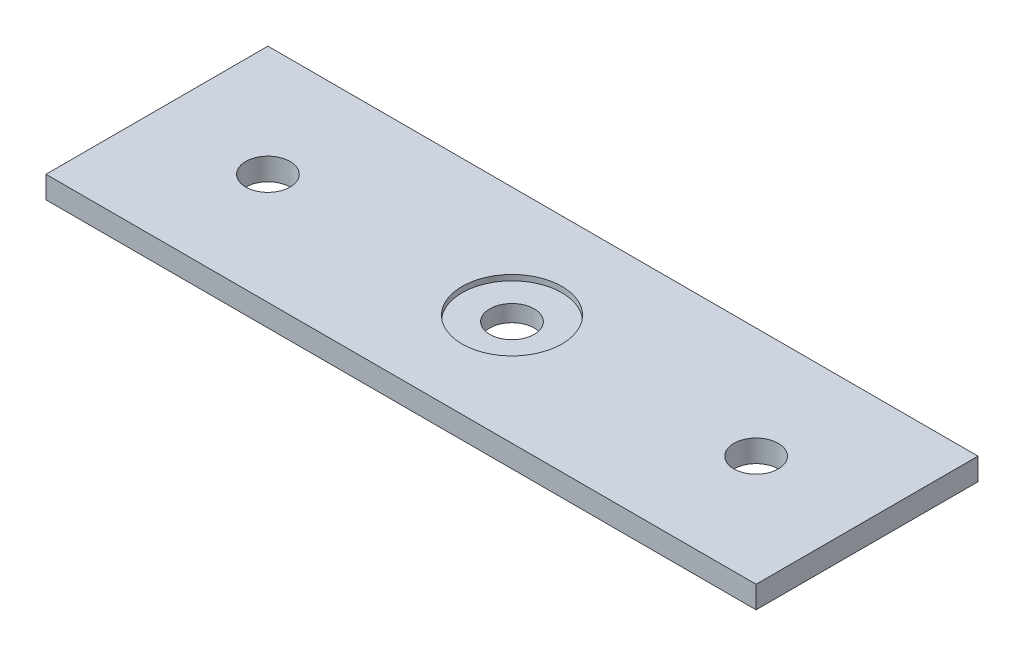
ISO-10303-21;
HEADER;
FILE_DESCRIPTION(('STEP AP214'),'2;1');
FILE_NAME('part.step','',(''),(''),'','','');
FILE_SCHEMA(('AUTOMOTIVE_DESIGN { 1 0 10303 214 1 1 1 1 }'));
ENDSEC;
DATA;
#1=APPLICATION_CONTEXT('core data for automotive mechanical design processes');
#2=APPLICATION_PROTOCOL_DEFINITION('international standard','automotive_design',2000,#1);
#3=PRODUCT_CONTEXT('',#1,'mechanical');
#4=PRODUCT('Part','Part','',(#3));
#5=PRODUCT_RELATED_PRODUCT_CATEGORY('part','',(#4));
#6=PRODUCT_DEFINITION_FORMATION('','',#4);
#7=PRODUCT_DEFINITION_CONTEXT('part definition',#1,'design');
#8=PRODUCT_DEFINITION('design','',#6,#7);
#9=PRODUCT_DEFINITION_SHAPE('','',#8);
#10=(LENGTH_UNIT() NAMED_UNIT(*) SI_UNIT(.MILLI.,.METRE.));
#11=(NAMED_UNIT(*) PLANE_ANGLE_UNIT() SI_UNIT($,.RADIAN.));
#12=(NAMED_UNIT(*) SI_UNIT($,.STERADIAN.) SOLID_ANGLE_UNIT());
#13=UNCERTAINTY_MEASURE_WITH_UNIT(LENGTH_MEASURE(1.E-05),#10,'distance_accuracy_value','');
#14=(GEOMETRIC_REPRESENTATION_CONTEXT(3) GLOBAL_UNCERTAINTY_ASSIGNED_CONTEXT((#13)) GLOBAL_UNIT_ASSIGNED_CONTEXT((#10,
#11,#12)) REPRESENTATION_CONTEXT('',''));
#15=CARTESIAN_POINT('',(0.,0.,0.));
#16=DIRECTION('',(0.,0.,1.));
#17=DIRECTION('',(1.,0.,0.));
#18=AXIS2_PLACEMENT_3D('',#15,#16,#17);
#19=CARTESIAN_POINT('',(0.,6.35,0.));
#20=DIRECTION('',(-1.,0.,0.));
#21=DIRECTION('',(0.,0.,1.));
#22=AXIS2_PLACEMENT_3D('',#19,#20,#21);
#23=PLANE('',#22);
#24=DIRECTION('',(0.,0.,-1.));
#25=VECTOR('',#24,1.);
#26=CARTESIAN_POINT('',(0.,0.,0.));
#27=LINE('',#26,#25);
#28=CARTESIAN_POINT('',(0.,0.,0.));
#29=VERTEX_POINT('',#28);
#30=CARTESIAN_POINT('',(0.,0.,-63.5));
#31=VERTEX_POINT('',#30);
#32=EDGE_CURVE('E100',#29,#31,#27,.T.);
#33=ORIENTED_EDGE('',*,*,#32,.T.);
#34=DIRECTION('',(0.,-1.,0.));
#35=VECTOR('',#34,1.);
#36=CARTESIAN_POINT('',(0.,6.35,-63.5));
#37=LINE('',#36,#35);
#38=CARTESIAN_POINT('',(0.,6.35,-63.5));
#39=VERTEX_POINT('',#38);
#40=EDGE_CURVE('E11',#39,#31,#37,.T.);
#41=ORIENTED_EDGE('',*,*,#40,.F.);
#42=DIRECTION('',(0.,0.,-1.));
#43=VECTOR('',#42,1.);
#44=CARTESIAN_POINT('',(0.,6.35,0.));
#45=LINE('',#44,#43);
#46=CARTESIAN_POINT('',(0.,6.35,0.));
#47=VERTEX_POINT('',#46);
#48=EDGE_CURVE('E88',#47,#39,#45,.T.);
#49=ORIENTED_EDGE('',*,*,#48,.F.);
#50=DIRECTION('',(0.,-1.,0.));
#51=VECTOR('',#50,1.);
#52=CARTESIAN_POINT('',(0.,6.35,0.));
#53=LINE('',#52,#51);
#54=EDGE_CURVE('E96',#47,#29,#53,.T.);
#55=ORIENTED_EDGE('',*,*,#54,.T.);
#56=EDGE_LOOP('',(#33,#41,#49,#55));
#57=FACE_BOUND('',#56,.T.);
#58=ADVANCED_FACE('F37',(#57),#23,.F.);
#59=CARTESIAN_POINT('',(0.,6.35,-63.5));
#60=DIRECTION('',(0.,0.,1.));
#61=DIRECTION('',(1.,0.,0.));
#62=AXIS2_PLACEMENT_3D('',#59,#60,#61);
#63=PLANE('',#62);
#64=DIRECTION('',(-1.,0.,0.));
#65=VECTOR('',#64,1.);
#66=CARTESIAN_POINT('',(0.,0.,-63.5));
#67=LINE('',#66,#65);
#68=CARTESIAN_POINT('',(-203.2,0.,-63.5));
#69=VERTEX_POINT('',#68);
#70=EDGE_CURVE('E92',#31,#69,#67,.T.);
#71=ORIENTED_EDGE('',*,*,#70,.T.);
#72=DIRECTION('',(0.,-1.,0.));
#73=VECTOR('',#72,1.);
#74=CARTESIAN_POINT('',(-203.2,6.35,-63.5));
#75=LINE('',#74,#73);
#76=CARTESIAN_POINT('',(-203.2,6.35,-63.5));
#77=VERTEX_POINT('',#76);
#78=EDGE_CURVE('E45',#77,#69,#75,.T.);
#79=ORIENTED_EDGE('',*,*,#78,.F.);
#80=DIRECTION('',(-1.,0.,0.));
#81=VECTOR('',#80,1.);
#82=CARTESIAN_POINT('',(0.,6.35,-63.5));
#83=LINE('',#82,#81);
#84=EDGE_CURVE('E83',#39,#77,#83,.T.);
#85=ORIENTED_EDGE('',*,*,#84,.F.);
#86=ORIENTED_EDGE('',*,*,#40,.T.);
#87=EDGE_LOOP('',(#71,#79,#85,#86));
#88=FACE_BOUND('',#87,.T.);
#89=ADVANCED_FACE('F91',(#88),#63,.F.);
#90=CARTESIAN_POINT('',(-203.2,6.35,0.));
#91=DIRECTION('',(1.,0.,0.));
#92=DIRECTION('',(0.,0.,-1.));
#93=AXIS2_PLACEMENT_3D('',#90,#91,#92);
#94=PLANE('',#93);
#95=DIRECTION('',(0.,0.,1.));
#96=VECTOR('',#95,1.);
#97=CARTESIAN_POINT('',(-203.2,0.,0.));
#98=LINE('',#97,#96);
#99=CARTESIAN_POINT('',(-203.2,0.,0.));
#100=VERTEX_POINT('',#99);
#101=EDGE_CURVE('E70',#69,#100,#98,.T.);
#102=ORIENTED_EDGE('',*,*,#101,.T.);
#103=DIRECTION('',(0.,-1.,0.));
#104=VECTOR('',#103,1.);
#105=CARTESIAN_POINT('',(-203.2,6.35,0.));
#106=LINE('',#105,#104);
#107=CARTESIAN_POINT('',(-203.2,6.35,0.));
#108=VERTEX_POINT('',#107);
#109=EDGE_CURVE('E93',#108,#100,#106,.T.);
#110=ORIENTED_EDGE('',*,*,#109,.F.);
#111=DIRECTION('',(0.,0.,1.));
#112=VECTOR('',#111,1.);
#113=CARTESIAN_POINT('',(-203.2,6.35,0.));
#114=LINE('',#113,#112);
#115=EDGE_CURVE('E86',#77,#108,#114,.T.);
#116=ORIENTED_EDGE('',*,*,#115,.F.);
#117=ORIENTED_EDGE('',*,*,#78,.T.);
#118=EDGE_LOOP('',(#102,#110,#116,#117));
#119=FACE_BOUND('',#118,.T.);
#120=ADVANCED_FACE('F94',(#119),#94,.F.);
#121=CARTESIAN_POINT('',(0.,6.35,0.));
#122=DIRECTION('',(0.,0.,-1.));
#123=DIRECTION('',(-1.,0.,0.));
#124=AXIS2_PLACEMENT_3D('',#121,#122,#123);
#125=PLANE('',#124);
#126=DIRECTION('',(1.,0.,0.));
#127=VECTOR('',#126,1.);
#128=CARTESIAN_POINT('',(0.,0.,0.));
#129=LINE('',#128,#127);
#130=EDGE_CURVE('E76',#100,#29,#129,.T.);
#131=ORIENTED_EDGE('',*,*,#130,.T.);
#132=ORIENTED_EDGE('',*,*,#54,.F.);
#133=DIRECTION('',(1.,0.,0.));
#134=VECTOR('',#133,1.);
#135=CARTESIAN_POINT('',(0.,6.35,0.));
#136=LINE('',#135,#134);
#137=EDGE_CURVE('E53',#108,#47,#136,.T.);
#138=ORIENTED_EDGE('',*,*,#137,.F.);
#139=ORIENTED_EDGE('',*,*,#109,.T.);
#140=EDGE_LOOP('',(#131,#132,#138,#139));
#141=FACE_BOUND('',#140,.T.);
#142=ADVANCED_FACE('F108',(#141),#125,.F.);
#143=CARTESIAN_POINT('',(0.,6.35,0.));
#144=DIRECTION('',(0.,1.,0.));
#145=DIRECTION('',(0.,0.,1.));
#146=AXIS2_PLACEMENT_3D('',#143,#144,#145);
#147=PLANE('',#146);
#148=CARTESIAN_POINT('',(-171.45,6.35,-31.75));
#149=DIRECTION('',(0.,1.,0.));
#150=DIRECTION('',(0.,0.,1.));
#151=AXIS2_PLACEMENT_3D('',#148,#149,#150);
#152=CIRCLE('',#151,6.35);
#153=CARTESIAN_POINT('',(-171.45,6.35,-25.4));
#154=VERTEX_POINT('',#153);
#155=EDGE_CURVE('E132',#154,#154,#152,.T.);
#156=ORIENTED_EDGE('',*,*,#155,.F.);
#157=EDGE_LOOP('',(#156));
#158=FACE_BOUND('',#157,.T.);
#159=CARTESIAN_POINT('',(-31.75,6.35,-31.75));
#160=DIRECTION('',(0.,1.,0.));
#161=DIRECTION('',(0.,0.,1.));
#162=AXIS2_PLACEMENT_3D('',#159,#160,#161);
#163=CIRCLE('',#162,6.35);
#164=CARTESIAN_POINT('',(-31.75,6.35,-25.4));
#165=VERTEX_POINT('',#164);
#166=EDGE_CURVE('E126',#165,#165,#163,.T.);
#167=ORIENTED_EDGE('',*,*,#166,.F.);
#168=EDGE_LOOP('',(#167));
#169=FACE_BOUND('',#168,.T.);
#170=CARTESIAN_POINT('',(-101.6,6.35,-31.75));
#171=DIRECTION('',(0.,1.,0.));
#172=DIRECTION('',(0.,0.,1.));
#173=AXIS2_PLACEMENT_3D('',#170,#171,#172);
#174=CIRCLE('',#173,14.2875);
#175=CARTESIAN_POINT('',(-101.6,6.35,-17.4625));
#176=VERTEX_POINT('',#175);
#177=EDGE_CURVE('E114',#176,#176,#174,.T.);
#178=ORIENTED_EDGE('',*,*,#177,.F.);
#179=EDGE_LOOP('',(#178));
#180=FACE_BOUND('',#179,.T.);
#181=ORIENTED_EDGE('',*,*,#48,.T.);
#182=ORIENTED_EDGE('',*,*,#84,.T.);
#183=ORIENTED_EDGE('',*,*,#115,.T.);
#184=ORIENTED_EDGE('',*,*,#137,.T.);
#185=EDGE_LOOP('',(#181,#182,#183,#184));
#186=FACE_BOUND('',#185,.T.);
#187=ADVANCED_FACE('F84',(#158,#169,#180,#186),#147,.T.);
#188=CARTESIAN_POINT('',(0.,0.,0.));
#189=DIRECTION('',(0.,1.,0.));
#190=DIRECTION('',(0.,0.,1.));
#191=AXIS2_PLACEMENT_3D('',#188,#189,#190);
#192=PLANE('',#191);
#193=CARTESIAN_POINT('',(-171.45,0.,-31.75));
#194=DIRECTION('',(0.,1.,0.));
#195=DIRECTION('',(0.,0.,1.));
#196=AXIS2_PLACEMENT_3D('',#193,#194,#195);
#197=CIRCLE('',#196,6.35);
#198=CARTESIAN_POINT('',(-171.45,0.,-25.4));
#199=VERTEX_POINT('',#198);
#200=EDGE_CURVE('E123',#199,#199,#197,.T.);
#201=ORIENTED_EDGE('',*,*,#200,.T.);
#202=EDGE_LOOP('',(#201));
#203=FACE_BOUND('',#202,.T.);
#204=CARTESIAN_POINT('',(-31.75,0.,-31.75));
#205=DIRECTION('',(0.,1.,0.));
#206=DIRECTION('',(0.,0.,1.));
#207=AXIS2_PLACEMENT_3D('',#204,#205,#206);
#208=CIRCLE('',#207,6.35);
#209=CARTESIAN_POINT('',(-31.75,0.,-25.4));
#210=VERTEX_POINT('',#209);
#211=EDGE_CURVE('E129',#210,#210,#208,.T.);
#212=ORIENTED_EDGE('',*,*,#211,.T.);
#213=EDGE_LOOP('',(#212));
#214=FACE_BOUND('',#213,.T.);
#215=CARTESIAN_POINT('',(-101.6,0.,-31.75));
#216=DIRECTION('',(0.,1.,0.));
#217=DIRECTION('',(0.,0.,1.));
#218=AXIS2_PLACEMENT_3D('',#215,#216,#217);
#219=CIRCLE('',#218,6.35000000000001);
#220=CARTESIAN_POINT('',(-101.6,0.,-25.4));
#221=VERTEX_POINT('',#220);
#222=EDGE_CURVE('E117',#221,#221,#219,.T.);
#223=ORIENTED_EDGE('',*,*,#222,.T.);
#224=EDGE_LOOP('',(#223));
#225=FACE_BOUND('',#224,.T.);
#226=ORIENTED_EDGE('',*,*,#32,.F.);
#227=ORIENTED_EDGE('',*,*,#130,.F.);
#228=ORIENTED_EDGE('',*,*,#101,.F.);
#229=ORIENTED_EDGE('',*,*,#70,.F.);
#230=EDGE_LOOP('',(#226,#227,#228,#229));
#231=FACE_BOUND('',#230,.T.);
#232=ADVANCED_FACE('F111',(#203,#214,#225,#231),#192,.F.);
#233=CARTESIAN_POINT('',(-101.6,4.7625,-31.75));
#234=DIRECTION('',(0.,1.,0.));
#235=DIRECTION('',(0.,0.,1.));
#236=AXIS2_PLACEMENT_3D('',#233,#234,#235);
#237=CYLINDRICAL_SURFACE('',#236,14.2875);
#238=CARTESIAN_POINT('',(-101.6,4.7625,-31.75));
#239=DIRECTION('',(0.,1.,0.));
#240=DIRECTION('',(0.,0.,1.));
#241=AXIS2_PLACEMENT_3D('',#238,#239,#240);
#242=CIRCLE('',#241,14.2875);
#243=CARTESIAN_POINT('',(-101.6,4.7625,-17.4625));
#244=VERTEX_POINT('',#243);
#245=EDGE_CURVE('E103',#244,#244,#242,.T.);
#246=ORIENTED_EDGE('',*,*,#245,.F.);
#247=EDGE_LOOP('',(#246));
#248=FACE_BOUND('',#247,.T.);
#249=ORIENTED_EDGE('',*,*,#177,.T.);
#250=EDGE_LOOP('',(#249));
#251=FACE_BOUND('',#250,.T.);
#252=ADVANCED_FACE('F154',(#248,#251),#237,.F.);
#253=CARTESIAN_POINT('',(-101.6,4.7625,-31.75));
#254=DIRECTION('',(0.,1.,0.));
#255=DIRECTION('',(0.,0.,1.));
#256=AXIS2_PLACEMENT_3D('',#253,#254,#255);
#257=PLANE('',#256);
#258=CARTESIAN_POINT('',(-101.6,4.7625,-31.75));
#259=DIRECTION('',(0.,1.,0.));
#260=DIRECTION('',(0.,0.,1.));
#261=AXIS2_PLACEMENT_3D('',#258,#259,#260);
#262=CIRCLE('',#261,6.35000000000001);
#263=CARTESIAN_POINT('',(-101.6,4.7625,-25.4));
#264=VERTEX_POINT('',#263);
#265=EDGE_CURVE('E120',#264,#264,#262,.T.);
#266=ORIENTED_EDGE('',*,*,#265,.F.);
#267=EDGE_LOOP('',(#266));
#268=FACE_BOUND('',#267,.T.);
#269=ORIENTED_EDGE('',*,*,#245,.T.);
#270=EDGE_LOOP('',(#269));
#271=FACE_BOUND('',#270,.T.);
#272=ADVANCED_FACE('F156',(#268,#271),#257,.T.);
#273=CARTESIAN_POINT('',(-101.6,0.,-31.75));
#274=DIRECTION('',(0.,1.,0.));
#275=DIRECTION('',(0.,0.,1.));
#276=AXIS2_PLACEMENT_3D('',#273,#274,#275);
#277=CYLINDRICAL_SURFACE('',#276,6.35000000000001);
#278=ORIENTED_EDGE('',*,*,#222,.F.);
#279=EDGE_LOOP('',(#278));
#280=FACE_BOUND('',#279,.T.);
#281=ORIENTED_EDGE('',*,*,#265,.T.);
#282=EDGE_LOOP('',(#281));
#283=FACE_BOUND('',#282,.T.);
#284=ADVANCED_FACE('F163',(#280,#283),#277,.F.);
#285=CARTESIAN_POINT('',(-31.75,0.,-31.75));
#286=DIRECTION('',(0.,1.,0.));
#287=DIRECTION('',(0.,0.,1.));
#288=AXIS2_PLACEMENT_3D('',#285,#286,#287);
#289=CYLINDRICAL_SURFACE('',#288,6.35);
#290=ORIENTED_EDGE('',*,*,#211,.F.);
#291=EDGE_LOOP('',(#290));
#292=FACE_BOUND('',#291,.T.);
#293=ORIENTED_EDGE('',*,*,#166,.T.);
#294=EDGE_LOOP('',(#293));
#295=FACE_BOUND('',#294,.T.);
#296=ADVANCED_FACE('F143',(#292,#295),#289,.F.);
#297=CARTESIAN_POINT('',(-171.45,0.,-31.75));
#298=DIRECTION('',(0.,1.,0.));
#299=DIRECTION('',(0.,0.,1.));
#300=AXIS2_PLACEMENT_3D('',#297,#298,#299);
#301=CYLINDRICAL_SURFACE('',#300,6.35);
#302=ORIENTED_EDGE('',*,*,#200,.F.);
#303=EDGE_LOOP('',(#302));
#304=FACE_BOUND('',#303,.T.);
#305=ORIENTED_EDGE('',*,*,#155,.T.);
#306=EDGE_LOOP('',(#305));
#307=FACE_BOUND('',#306,.T.);
#308=ADVANCED_FACE('F140',(#304,#307),#301,.F.);
#309=CLOSED_SHELL('',(#58,#89,#120,#142,#187,#232,#252,#272,#284,#296,#308));
#310=MANIFOLD_SOLID_BREP('B2',#309);
#311=ADVANCED_BREP_SHAPE_REPRESENTATION('',(#18,#310),#14);
#312=SHAPE_DEFINITION_REPRESENTATION(#9,#311);
ENDSEC;
END-ISO-10303-21;
